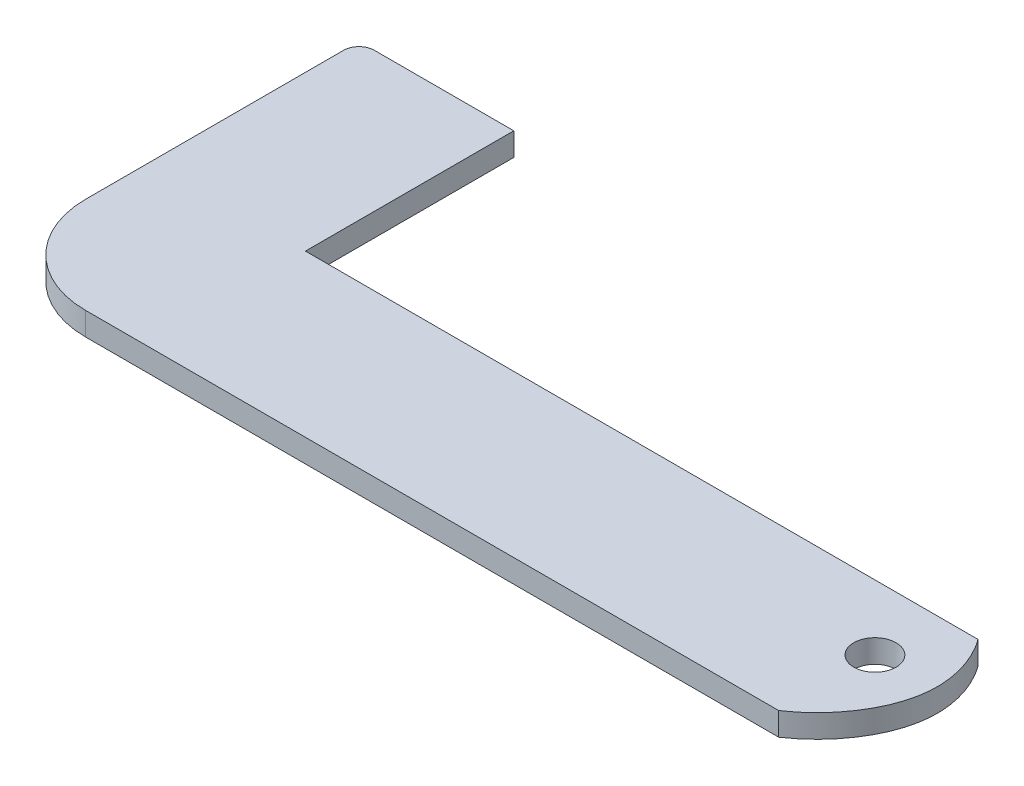
ISO-10303-21;
HEADER;
FILE_DESCRIPTION(('STEP AP214'),'2;1');
FILE_NAME('part.step','',(''),(''),'','','');
FILE_SCHEMA(('AUTOMOTIVE_DESIGN { 1 0 10303 214 1 1 1 1 }'));
ENDSEC;
DATA;
#1=APPLICATION_CONTEXT('core data for automotive mechanical design processes');
#2=APPLICATION_PROTOCOL_DEFINITION('international standard','automotive_design',2000,#1);
#3=PRODUCT_CONTEXT('',#1,'mechanical');
#4=PRODUCT('Part','Part','',(#3));
#5=PRODUCT_RELATED_PRODUCT_CATEGORY('part','',(#4));
#6=PRODUCT_DEFINITION_FORMATION('','',#4);
#7=PRODUCT_DEFINITION_CONTEXT('part definition',#1,'design');
#8=PRODUCT_DEFINITION('design','',#6,#7);
#9=PRODUCT_DEFINITION_SHAPE('','',#8);
#10=(LENGTH_UNIT() NAMED_UNIT(*) SI_UNIT(.MILLI.,.METRE.));
#11=(NAMED_UNIT(*) PLANE_ANGLE_UNIT() SI_UNIT($,.RADIAN.));
#12=(NAMED_UNIT(*) SI_UNIT($,.STERADIAN.) SOLID_ANGLE_UNIT());
#13=UNCERTAINTY_MEASURE_WITH_UNIT(LENGTH_MEASURE(1.E-05),#10,'distance_accuracy_value','');
#14=(GEOMETRIC_REPRESENTATION_CONTEXT(3) GLOBAL_UNCERTAINTY_ASSIGNED_CONTEXT((#13)) GLOBAL_UNIT_ASSIGNED_CONTEXT((#10,
#11,#12)) REPRESENTATION_CONTEXT('',''));
#15=CARTESIAN_POINT('',(0.,0.,0.));
#16=DIRECTION('',(0.,0.,1.));
#17=DIRECTION('',(1.,0.,0.));
#18=AXIS2_PLACEMENT_3D('',#15,#16,#17);
#19=CARTESIAN_POINT('',(52.1188789900586,3.,3.02284138112952));
#20=DIRECTION('',(0.,1.,0.));
#21=DIRECTION('',(0.,0.,1.));
#22=AXIS2_PLACEMENT_3D('',#19,#20,#21);
#23=PLANE('',#22);
#24=CARTESIAN_POINT('',(45.,3.,12.5));
#25=CARTESIAN_POINT('',(49.0283196049113,3.,9.82282141061907));
#26=CARTESIAN_POINT('',(54.055554594042,3.,2.68493718579333));
#27=CARTESIAN_POINT('',(51.9177719998844,3.,-5.44706154318203));
#28=CARTESIAN_POINT('',(50.2709249827568,3.,-7.99384429308928));
#29=CARTESIAN_POINT('',(49.9411048176006,3.,-8.44208936747418));
#30=B_SPLINE_CURVE_WITH_KNOTS('',3,(#24,#25,#26,#27,#28,#29),.UNSPECIFIED.,.F.,.F.,(4,1,1,4),
(0.210171727817662,0.706186912981712,0.94593660651377,1.),.UNSPECIFIED.);
#31=CARTESIAN_POINT('',(45.,3.,12.5));
#32=VERTEX_POINT('',#31);
#33=CARTESIAN_POINT('',(49.9411048176006,3.,-8.44208936747418));
#34=VERTEX_POINT('',#33);
#35=EDGE_CURVE('E170',#32,#34,#30,.T.);
#36=ORIENTED_EDGE('',*,*,#35,.T.);
#37=DIRECTION('',(-1.,0.,0.));
#38=VECTOR('',#37,1.);
#39=CARTESIAN_POINT('',(-37.395508702412,3.,-8.44208936747452));
#40=LINE('',#39,#38);
#41=CARTESIAN_POINT('',(-37.395508702412,3.,-8.44208936747452));
#42=VERTEX_POINT('',#41);
#43=EDGE_CURVE('E101',#34,#42,#40,.T.);
#44=ORIENTED_EDGE('',*,*,#43,.T.);
#45=DIRECTION('',(0.,0.,-1.));
#46=VECTOR('',#45,1.);
#47=CARTESIAN_POINT('',(-37.395508702412,3.,-35.5));
#48=LINE('',#47,#46);
#49=CARTESIAN_POINT('',(-37.395508702412,3.,-35.5));
#50=VERTEX_POINT('',#49);
#51=EDGE_CURVE('E191',#42,#50,#48,.T.);
#52=ORIENTED_EDGE('',*,*,#51,.T.);
#53=DIRECTION('',(-1.,0.,0.));
#54=VECTOR('',#53,1.);
#55=CARTESIAN_POINT('',(-37.395508702412,3.,-35.5));
#56=LINE('',#55,#54);
#57=CARTESIAN_POINT('',(-55.5,3.,-35.5));
#58=VERTEX_POINT('',#57);
#59=EDGE_CURVE('E205',#50,#58,#56,.T.);
#60=ORIENTED_EDGE('',*,*,#59,.T.);
#61=CARTESIAN_POINT('',(-55.5,3.,-33.5));
#62=DIRECTION('',(0.,1.,0.));
#63=DIRECTION('',(0.,0.,1.));
#64=AXIS2_PLACEMENT_3D('',#61,#62,#63);
#65=CIRCLE('',#64,2.);
#66=CARTESIAN_POINT('',(-57.5,3.,-33.5));
#67=VERTEX_POINT('',#66);
#68=EDGE_CURVE('E120',#58,#67,#65,.T.);
#69=ORIENTED_EDGE('',*,*,#68,.T.);
#70=DIRECTION('',(0.,0.,1.));
#71=VECTOR('',#70,1.);
#72=CARTESIAN_POINT('',(-57.5,3.,-33.5));
#73=LINE('',#72,#71);
#74=CARTESIAN_POINT('',(-57.5,3.,0.));
#75=VERTEX_POINT('',#74);
#76=EDGE_CURVE('E114',#67,#75,#73,.T.);
#77=ORIENTED_EDGE('',*,*,#76,.T.);
#78=CARTESIAN_POINT('',(-45.,3.,0.));
#79=DIRECTION('',(0.,1.,0.));
#80=DIRECTION('',(0.,0.,1.));
#81=AXIS2_PLACEMENT_3D('',#78,#79,#80);
#82=CIRCLE('',#81,12.5);
#83=CARTESIAN_POINT('',(-45.,3.,12.5));
#84=VERTEX_POINT('',#83);
#85=EDGE_CURVE('E118',#75,#84,#82,.T.);
#86=ORIENTED_EDGE('',*,*,#85,.T.);
#87=DIRECTION('',(1.,0.,0.));
#88=VECTOR('',#87,1.);
#89=CARTESIAN_POINT('',(-45.,3.,12.5));
#90=LINE('',#89,#88);
#91=EDGE_CURVE('E58',#84,#32,#90,.T.);
#92=ORIENTED_EDGE('',*,*,#91,.T.);
#93=EDGE_LOOP('',(#36,#44,#52,#60,#69,#77,#86,#92));
#94=FACE_BOUND('',#93,.T.);
#95=CARTESIAN_POINT('',(45.,3.,0.));
#96=DIRECTION('',(0.,1.,0.));
#97=DIRECTION('',(0.,0.,1.));
#98=AXIS2_PLACEMENT_3D('',#95,#96,#97);
#99=CIRCLE('',#98,2.75);
#100=CARTESIAN_POINT('',(45.,3.,2.75));
#101=VERTEX_POINT('',#100);
#102=EDGE_CURVE('E149',#101,#101,#99,.T.);
#103=ORIENTED_EDGE('',*,*,#102,.F.);
#104=EDGE_LOOP('',(#103));
#105=FACE_BOUND('',#104,.T.);
#106=ADVANCED_FACE('F39',(#94,#105),#23,.T.);
#107=CARTESIAN_POINT('',(52.1188789900586,0.,3.02284138112952));
#108=DIRECTION('',(0.,1.,0.));
#109=DIRECTION('',(0.,0.,1.));
#110=AXIS2_PLACEMENT_3D('',#107,#108,#109);
#111=PLANE('',#110);
#112=CARTESIAN_POINT('',(45.,0.,12.5));
#113=CARTESIAN_POINT('',(49.0283196049113,0.,9.82282141061907));
#114=CARTESIAN_POINT('',(54.055554594042,0.,2.68493718579333));
#115=CARTESIAN_POINT('',(51.9177719998844,0.,-5.44706154318203));
#116=CARTESIAN_POINT('',(50.2709249827568,0.,-7.99384429308928));
#117=CARTESIAN_POINT('',(49.9411048176006,0.,-8.44208936747418));
#118=B_SPLINE_CURVE_WITH_KNOTS('',3,(#112,#113,#114,#115,#116,#117),.UNSPECIFIED.,.F.,.F.,(4,1,
1,4),(0.210171727817662,0.706186912981712,0.94593660651377,1.),.UNSPECIFIED.);
#119=CARTESIAN_POINT('',(45.,0.,12.5));
#120=VERTEX_POINT('',#119);
#121=CARTESIAN_POINT('',(49.9411048176006,0.,-8.44208936747418));
#122=VERTEX_POINT('',#121);
#123=EDGE_CURVE('E142',#120,#122,#118,.T.);
#124=ORIENTED_EDGE('',*,*,#123,.F.);
#125=DIRECTION('',(1.,0.,0.));
#126=VECTOR('',#125,1.);
#127=CARTESIAN_POINT('',(-45.,0.,12.5));
#128=LINE('',#127,#126);
#129=CARTESIAN_POINT('',(-45.,0.,12.5));
#130=VERTEX_POINT('',#129);
#131=EDGE_CURVE('E93',#130,#120,#128,.T.);
#132=ORIENTED_EDGE('',*,*,#131,.F.);
#133=CARTESIAN_POINT('',(-45.,0.,0.));
#134=DIRECTION('',(0.,1.,0.));
#135=DIRECTION('',(0.,0.,1.));
#136=AXIS2_PLACEMENT_3D('',#133,#134,#135);
#137=CIRCLE('',#136,12.5);
#138=CARTESIAN_POINT('',(-57.5,0.,0.));
#139=VERTEX_POINT('',#138);
#140=EDGE_CURVE('E87',#139,#130,#137,.T.);
#141=ORIENTED_EDGE('',*,*,#140,.F.);
#142=DIRECTION('',(0.,0.,1.));
#143=VECTOR('',#142,1.);
#144=CARTESIAN_POINT('',(-57.5,0.,-33.5));
#145=LINE('',#144,#143);
#146=CARTESIAN_POINT('',(-57.5,0.,-33.5));
#147=VERTEX_POINT('',#146);
#148=EDGE_CURVE('E129',#147,#139,#145,.T.);
#149=ORIENTED_EDGE('',*,*,#148,.F.);
#150=CARTESIAN_POINT('',(-55.5,0.,-33.5));
#151=DIRECTION('',(0.,1.,0.));
#152=DIRECTION('',(0.,0.,1.));
#153=AXIS2_PLACEMENT_3D('',#150,#151,#152);
#154=CIRCLE('',#153,2.);
#155=CARTESIAN_POINT('',(-55.5,0.,-35.5));
#156=VERTEX_POINT('',#155);
#157=EDGE_CURVE('E161',#156,#147,#154,.T.);
#158=ORIENTED_EDGE('',*,*,#157,.F.);
#159=DIRECTION('',(-1.,0.,0.));
#160=VECTOR('',#159,1.);
#161=CARTESIAN_POINT('',(-37.395508702412,0.,-35.5));
#162=LINE('',#161,#160);
#163=CARTESIAN_POINT('',(-37.395508702412,0.,-35.5));
#164=VERTEX_POINT('',#163);
#165=EDGE_CURVE('E158',#164,#156,#162,.T.);
#166=ORIENTED_EDGE('',*,*,#165,.F.);
#167=DIRECTION('',(0.,0.,-1.));
#168=VECTOR('',#167,1.);
#169=CARTESIAN_POINT('',(-37.395508702412,0.,-35.5));
#170=LINE('',#169,#168);
#171=CARTESIAN_POINT('',(-37.395508702412,0.,-8.44208936747452));
#172=VERTEX_POINT('',#171);
#173=EDGE_CURVE('E155',#172,#164,#170,.T.);
#174=ORIENTED_EDGE('',*,*,#173,.F.);
#175=DIRECTION('',(-1.,0.,0.));
#176=VECTOR('',#175,1.);
#177=CARTESIAN_POINT('',(-37.395508702412,0.,-8.44208936747452));
#178=LINE('',#177,#176);
#179=EDGE_CURVE('E148',#122,#172,#178,.T.);
#180=ORIENTED_EDGE('',*,*,#179,.F.);
#181=EDGE_LOOP('',(#124,#132,#141,#149,#158,#166,#174,#180));
#182=FACE_BOUND('',#181,.T.);
#183=CARTESIAN_POINT('',(45.,0.,0.));
#184=DIRECTION('',(0.,1.,0.));
#185=DIRECTION('',(0.,0.,1.));
#186=AXIS2_PLACEMENT_3D('',#183,#184,#185);
#187=CIRCLE('',#186,2.75);
#188=CARTESIAN_POINT('',(45.,0.,2.75));
#189=VERTEX_POINT('',#188);
#190=EDGE_CURVE('E217',#189,#189,#187,.T.);
#191=ORIENTED_EDGE('',*,*,#190,.T.);
#192=EDGE_LOOP('',(#191));
#193=FACE_BOUND('',#192,.T.);
#194=ADVANCED_FACE('F195',(#182,#193),#111,.F.);
#195=DIRECTION('',(0.,-1.,0.));
#196=VECTOR('',#195,1.);
#197=SURFACE_OF_LINEAR_EXTRUSION('',#30,#196);
#198=ORIENTED_EDGE('',*,*,#123,.T.);
#199=DIRECTION('',(0.,-1.,0.));
#200=VECTOR('',#199,1.);
#201=CARTESIAN_POINT('',(49.9411048176006,3.,-8.44208936747418));
#202=LINE('',#201,#200);
#203=EDGE_CURVE('E11',#34,#122,#202,.T.);
#204=ORIENTED_EDGE('',*,*,#203,.F.);
#205=ORIENTED_EDGE('',*,*,#35,.F.);
#206=DIRECTION('',(0.,-1.,0.));
#207=VECTOR('',#206,1.);
#208=CARTESIAN_POINT('',(45.,3.,12.5));
#209=LINE('',#208,#207);
#210=EDGE_CURVE('E138',#32,#120,#209,.T.);
#211=ORIENTED_EDGE('',*,*,#210,.T.);
#212=EDGE_LOOP('',(#198,#204,#205,#211));
#213=FACE_BOUND('',#212,.T.);
#214=ADVANCED_FACE('F41',(#213),#197,.F.);
#215=CARTESIAN_POINT('',(-37.395508702412,3.,-8.44208936747452));
#216=DIRECTION('',(0.,0.,1.));
#217=DIRECTION('',(1.,0.,0.));
#218=AXIS2_PLACEMENT_3D('',#215,#216,#217);
#219=PLANE('',#218);
#220=ORIENTED_EDGE('',*,*,#179,.T.);
#221=DIRECTION('',(0.,-1.,0.));
#222=VECTOR('',#221,1.);
#223=CARTESIAN_POINT('',(-37.395508702412,3.,-8.44208936747452));
#224=LINE('',#223,#222);
#225=EDGE_CURVE('E50',#42,#172,#224,.T.);
#226=ORIENTED_EDGE('',*,*,#225,.F.);
#227=ORIENTED_EDGE('',*,*,#43,.F.);
#228=ORIENTED_EDGE('',*,*,#203,.T.);
#229=EDGE_LOOP('',(#220,#226,#227,#228));
#230=FACE_BOUND('',#229,.T.);
#231=ADVANCED_FACE('F250',(#230),#219,.F.);
#232=CARTESIAN_POINT('',(-37.395508702412,3.,-35.5));
#233=DIRECTION('',(-1.,0.,0.));
#234=DIRECTION('',(0.,0.,1.));
#235=AXIS2_PLACEMENT_3D('',#232,#233,#234);
#236=PLANE('',#235);
#237=ORIENTED_EDGE('',*,*,#173,.T.);
#238=DIRECTION('',(0.,-1.,0.));
#239=VECTOR('',#238,1.);
#240=CARTESIAN_POINT('',(-37.395508702412,3.,-35.5));
#241=LINE('',#240,#239);
#242=EDGE_CURVE('E181',#50,#164,#241,.T.);
#243=ORIENTED_EDGE('',*,*,#242,.F.);
#244=ORIENTED_EDGE('',*,*,#51,.F.);
#245=ORIENTED_EDGE('',*,*,#225,.T.);
#246=EDGE_LOOP('',(#237,#243,#244,#245));
#247=FACE_BOUND('',#246,.T.);
#248=ADVANCED_FACE('F189',(#247),#236,.F.);
#249=CARTESIAN_POINT('',(-37.395508702412,3.,-35.5));
#250=DIRECTION('',(0.,0.,1.));
#251=DIRECTION('',(1.,0.,0.));
#252=AXIS2_PLACEMENT_3D('',#249,#250,#251);
#253=PLANE('',#252);
#254=ORIENTED_EDGE('',*,*,#165,.T.);
#255=DIRECTION('',(0.,-1.,0.));
#256=VECTOR('',#255,1.);
#257=CARTESIAN_POINT('',(-55.5,3.,-35.5));
#258=LINE('',#257,#256);
#259=EDGE_CURVE('E177',#58,#156,#258,.T.);
#260=ORIENTED_EDGE('',*,*,#259,.F.);
#261=ORIENTED_EDGE('',*,*,#59,.F.);
#262=ORIENTED_EDGE('',*,*,#242,.T.);
#263=EDGE_LOOP('',(#254,#260,#261,#262));
#264=FACE_BOUND('',#263,.T.);
#265=ADVANCED_FACE('F200',(#264),#253,.F.);
#266=CARTESIAN_POINT('',(-55.5,3.,-33.5));
#267=DIRECTION('',(0.,-1.,0.));
#268=DIRECTION('',(0.,0.,-1.));
#269=AXIS2_PLACEMENT_3D('',#266,#267,#268);
#270=CYLINDRICAL_SURFACE('',#269,2.);
#271=ORIENTED_EDGE('',*,*,#157,.T.);
#272=DIRECTION('',(0.,-1.,0.));
#273=VECTOR('',#272,1.);
#274=CARTESIAN_POINT('',(-57.5,3.,-33.5));
#275=LINE('',#274,#273);
#276=EDGE_CURVE('E131',#67,#147,#275,.T.);
#277=ORIENTED_EDGE('',*,*,#276,.F.);
#278=ORIENTED_EDGE('',*,*,#68,.F.);
#279=ORIENTED_EDGE('',*,*,#259,.T.);
#280=EDGE_LOOP('',(#271,#277,#278,#279));
#281=FACE_BOUND('',#280,.T.);
#282=ADVANCED_FACE('F203',(#281),#270,.T.);
#283=CARTESIAN_POINT('',(-57.5,3.,-33.5));
#284=DIRECTION('',(1.,0.,0.));
#285=DIRECTION('',(0.,0.,-1.));
#286=AXIS2_PLACEMENT_3D('',#283,#284,#285);
#287=PLANE('',#286);
#288=ORIENTED_EDGE('',*,*,#148,.T.);
#289=DIRECTION('',(0.,-1.,0.));
#290=VECTOR('',#289,1.);
#291=CARTESIAN_POINT('',(-57.5,3.,0.));
#292=LINE('',#291,#290);
#293=EDGE_CURVE('E126',#75,#139,#292,.T.);
#294=ORIENTED_EDGE('',*,*,#293,.F.);
#295=ORIENTED_EDGE('',*,*,#76,.F.);
#296=ORIENTED_EDGE('',*,*,#276,.T.);
#297=EDGE_LOOP('',(#288,#294,#295,#296));
#298=FACE_BOUND('',#297,.T.);
#299=ADVANCED_FACE('F127',(#298),#287,.F.);
#300=CARTESIAN_POINT('',(-45.,3.,0.));
#301=DIRECTION('',(0.,-1.,0.));
#302=DIRECTION('',(0.,0.,-1.));
#303=AXIS2_PLACEMENT_3D('',#300,#301,#302);
#304=CYLINDRICAL_SURFACE('',#303,12.5);
#305=ORIENTED_EDGE('',*,*,#140,.T.);
#306=DIRECTION('',(0.,-1.,0.));
#307=VECTOR('',#306,1.);
#308=CARTESIAN_POINT('',(-45.,3.,12.5));
#309=LINE('',#308,#307);
#310=EDGE_CURVE('E132',#84,#130,#309,.T.);
#311=ORIENTED_EDGE('',*,*,#310,.F.);
#312=ORIENTED_EDGE('',*,*,#85,.F.);
#313=ORIENTED_EDGE('',*,*,#293,.T.);
#314=EDGE_LOOP('',(#305,#311,#312,#313));
#315=FACE_BOUND('',#314,.T.);
#316=ADVANCED_FACE('F134',(#315),#304,.T.);
#317=CARTESIAN_POINT('',(-45.,3.,12.5));
#318=DIRECTION('',(0.,0.,-1.));
#319=DIRECTION('',(-1.,0.,0.));
#320=AXIS2_PLACEMENT_3D('',#317,#318,#319);
#321=PLANE('',#320);
#322=ORIENTED_EDGE('',*,*,#131,.T.);
#323=ORIENTED_EDGE('',*,*,#210,.F.);
#324=ORIENTED_EDGE('',*,*,#91,.F.);
#325=ORIENTED_EDGE('',*,*,#310,.T.);
#326=EDGE_LOOP('',(#322,#323,#324,#325));
#327=FACE_BOUND('',#326,.T.);
#328=ADVANCED_FACE('F238',(#327),#321,.F.);
#329=CARTESIAN_POINT('',(45.,3.,0.));
#330=DIRECTION('',(0.,-1.,0.));
#331=DIRECTION('',(0.,0.,-1.));
#332=AXIS2_PLACEMENT_3D('',#329,#330,#331);
#333=CYLINDRICAL_SURFACE('',#332,2.75);
#334=ORIENTED_EDGE('',*,*,#102,.T.);
#335=EDGE_LOOP('',(#334));
#336=FACE_BOUND('',#335,.T.);
#337=ORIENTED_EDGE('',*,*,#190,.F.);
#338=EDGE_LOOP('',(#337));
#339=FACE_BOUND('',#338,.T.);
#340=ADVANCED_FACE('F228',(#336,#339),#333,.F.);
#341=CLOSED_SHELL('',(#106,#194,#214,#231,#248,#265,#282,#299,#316,#328,#340));
#342=MANIFOLD_SOLID_BREP('B2',#341);
#343=ADVANCED_BREP_SHAPE_REPRESENTATION('',(#18,#342),#14);
#344=SHAPE_DEFINITION_REPRESENTATION(#9,#343);
ENDSEC;
END-ISO-10303-21;
